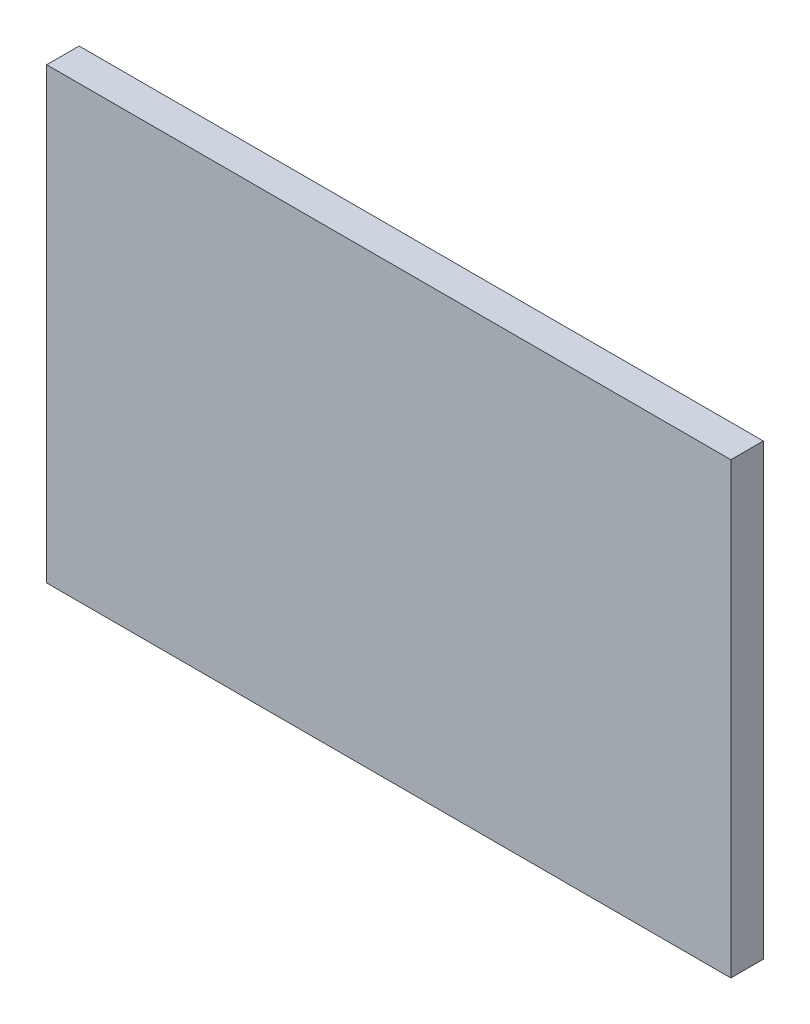
ISO-10303-21;
HEADER;
FILE_DESCRIPTION(('STEP AP214'),'2;1');
FILE_NAME('part.step','',(''),(''),'','','');
FILE_SCHEMA(('AUTOMOTIVE_DESIGN { 1 0 10303 214 1 1 1 1 }'));
ENDSEC;
DATA;
#1=APPLICATION_CONTEXT('core data for automotive mechanical design processes');
#2=APPLICATION_PROTOCOL_DEFINITION('international standard','automotive_design',2000,#1);
#3=PRODUCT_CONTEXT('',#1,'mechanical');
#4=PRODUCT('Part','Part','',(#3));
#5=PRODUCT_RELATED_PRODUCT_CATEGORY('part','',(#4));
#6=PRODUCT_DEFINITION_FORMATION('','',#4);
#7=PRODUCT_DEFINITION_CONTEXT('part definition',#1,'design');
#8=PRODUCT_DEFINITION('design','',#6,#7);
#9=PRODUCT_DEFINITION_SHAPE('','',#8);
#10=(LENGTH_UNIT() NAMED_UNIT(*) SI_UNIT(.MILLI.,.METRE.));
#11=(NAMED_UNIT(*) PLANE_ANGLE_UNIT() SI_UNIT($,.RADIAN.));
#12=(NAMED_UNIT(*) SI_UNIT($,.STERADIAN.) SOLID_ANGLE_UNIT());
#13=UNCERTAINTY_MEASURE_WITH_UNIT(LENGTH_MEASURE(1.E-05),#10,'distance_accuracy_value','');
#14=(GEOMETRIC_REPRESENTATION_CONTEXT(3) GLOBAL_UNCERTAINTY_ASSIGNED_CONTEXT((#13)) GLOBAL_UNIT_ASSIGNED_CONTEXT((#10,
#11,#12)) REPRESENTATION_CONTEXT('',''));
#15=CARTESIAN_POINT('',(0.,0.,0.));
#16=DIRECTION('',(0.,0.,1.));
#17=DIRECTION('',(1.,0.,0.));
#18=AXIS2_PLACEMENT_3D('',#15,#16,#17);
#19=CARTESIAN_POINT('',(-17.7,-16.75,3.24));
#20=DIRECTION('',(0.,0.,1.));
#21=DIRECTION('',(1.,0.,0.));
#22=AXIS2_PLACEMENT_3D('',#19,#20,#21);
#23=PLANE('',#22);
#24=DIRECTION('',(1.,0.,0.));
#25=VECTOR('',#24,1.);
#26=CARTESIAN_POINT('',(-26.35,-28.1,3.24));
#27=LINE('',#26,#25);
#28=CARTESIAN_POINT('',(-35.,-28.1,3.24));
#29=VERTEX_POINT('',#28);
#30=CARTESIAN_POINT('',(-0.399999999999994,-28.1,3.24));
#31=VERTEX_POINT('',#30);
#32=EDGE_CURVE('E20',#29,#31,#27,.T.);
#33=ORIENTED_EDGE('',*,*,#32,.T.);
#34=DIRECTION('',(0.,1.,0.));
#35=VECTOR('',#34,1.);
#36=CARTESIAN_POINT('',(-0.4,-16.75,3.24));
#37=LINE('',#36,#35);
#38=CARTESIAN_POINT('',(-0.4,-5.4,3.24));
#39=VERTEX_POINT('',#38);
#40=EDGE_CURVE('E106',#31,#39,#37,.T.);
#41=ORIENTED_EDGE('',*,*,#40,.T.);
#42=DIRECTION('',(-1.,0.,0.));
#43=VECTOR('',#42,1.);
#44=CARTESIAN_POINT('',(-17.7,-5.4,3.24));
#45=LINE('',#44,#43);
#46=CARTESIAN_POINT('',(-35.,-5.4,3.24));
#47=VERTEX_POINT('',#46);
#48=EDGE_CURVE('E75',#39,#47,#45,.T.);
#49=ORIENTED_EDGE('',*,*,#48,.T.);
#50=DIRECTION('',(0.,-1.,0.));
#51=VECTOR('',#50,1.);
#52=CARTESIAN_POINT('',(-35.,-16.75,3.24));
#53=LINE('',#52,#51);
#54=EDGE_CURVE('E11',#47,#29,#53,.T.);
#55=ORIENTED_EDGE('',*,*,#54,.T.);
#56=EDGE_LOOP('',(#33,#41,#49,#55));
#57=FACE_BOUND('',#56,.T.);
#58=ADVANCED_FACE('F16',(#57),#23,.T.);
#59=CARTESIAN_POINT('',(-17.7,-16.75,1.6));
#60=DIRECTION('',(0.,0.,1.));
#61=DIRECTION('',(1.,0.,0.));
#62=AXIS2_PLACEMENT_3D('',#59,#60,#61);
#63=PLANE('',#62);
#64=DIRECTION('',(1.,0.,0.));
#65=VECTOR('',#64,1.);
#66=CARTESIAN_POINT('',(-26.35,-28.1,1.6));
#67=LINE('',#66,#65);
#68=CARTESIAN_POINT('',(-35.,-28.1,1.6));
#69=VERTEX_POINT('',#68);
#70=CARTESIAN_POINT('',(-0.399999999999994,-28.1,1.6));
#71=VERTEX_POINT('',#70);
#72=EDGE_CURVE('E94',#69,#71,#67,.T.);
#73=ORIENTED_EDGE('',*,*,#72,.F.);
#74=DIRECTION('',(0.,-1.,0.));
#75=VECTOR('',#74,1.);
#76=CARTESIAN_POINT('',(-35.,-16.75,1.6));
#77=LINE('',#76,#75);
#78=CARTESIAN_POINT('',(-35.,-5.4,1.6));
#79=VERTEX_POINT('',#78);
#80=EDGE_CURVE('E27',#79,#69,#77,.T.);
#81=ORIENTED_EDGE('',*,*,#80,.F.);
#82=DIRECTION('',(-1.,0.,0.));
#83=VECTOR('',#82,1.);
#84=CARTESIAN_POINT('',(-17.7,-5.4,1.6));
#85=LINE('',#84,#83);
#86=CARTESIAN_POINT('',(-0.4,-5.4,1.6));
#87=VERTEX_POINT('',#86);
#88=EDGE_CURVE('E65',#87,#79,#85,.T.);
#89=ORIENTED_EDGE('',*,*,#88,.F.);
#90=DIRECTION('',(0.,1.,0.));
#91=VECTOR('',#90,1.);
#92=CARTESIAN_POINT('',(-0.4,-16.75,1.6));
#93=LINE('',#92,#91);
#94=EDGE_CURVE('E84',#71,#87,#93,.T.);
#95=ORIENTED_EDGE('',*,*,#94,.F.);
#96=EDGE_LOOP('',(#73,#81,#89,#95));
#97=FACE_BOUND('',#96,.T.);
#98=ADVANCED_FACE('F18',(#97),#63,.F.);
#99=CARTESIAN_POINT('',(-35.,-16.75,3.24));
#100=DIRECTION('',(1.,0.,0.));
#101=DIRECTION('',(0.,1.,0.));
#102=AXIS2_PLACEMENT_3D('',#99,#100,#101);
#103=PLANE('',#102);
#104=ORIENTED_EDGE('',*,*,#80,.T.);
#105=DIRECTION('',(0.,0.,-1.));
#106=VECTOR('',#105,1.);
#107=CARTESIAN_POINT('',(-35.,-28.1,3.24));
#108=LINE('',#107,#106);
#109=EDGE_CURVE('E78',#29,#69,#108,.T.);
#110=ORIENTED_EDGE('',*,*,#109,.F.);
#111=ORIENTED_EDGE('',*,*,#54,.F.);
#112=DIRECTION('',(0.,0.,-1.));
#113=VECTOR('',#112,1.);
#114=CARTESIAN_POINT('',(-35.,-5.4,3.24));
#115=LINE('',#114,#113);
#116=EDGE_CURVE('E108',#47,#79,#115,.T.);
#117=ORIENTED_EDGE('',*,*,#116,.T.);
#118=EDGE_LOOP('',(#104,#110,#111,#117));
#119=FACE_BOUND('',#118,.T.);
#120=ADVANCED_FACE('F79',(#119),#103,.F.);
#121=CARTESIAN_POINT('',(-17.7,-5.4,3.24));
#122=DIRECTION('',(0.,-1.,0.));
#123=DIRECTION('',(0.,0.,-1.));
#124=AXIS2_PLACEMENT_3D('',#121,#122,#123);
#125=PLANE('',#124);
#126=ORIENTED_EDGE('',*,*,#88,.T.);
#127=ORIENTED_EDGE('',*,*,#116,.F.);
#128=ORIENTED_EDGE('',*,*,#48,.F.);
#129=DIRECTION('',(0.,0.,-1.));
#130=VECTOR('',#129,1.);
#131=CARTESIAN_POINT('',(-0.4,-5.4,3.24));
#132=LINE('',#131,#130);
#133=EDGE_CURVE('E105',#39,#87,#132,.T.);
#134=ORIENTED_EDGE('',*,*,#133,.T.);
#135=EDGE_LOOP('',(#126,#127,#128,#134));
#136=FACE_BOUND('',#135,.T.);
#137=ADVANCED_FACE('F121',(#136),#125,.F.);
#138=CARTESIAN_POINT('',(-0.4,-16.75,3.24));
#139=DIRECTION('',(-1.,0.,0.));
#140=DIRECTION('',(0.,1.,0.));
#141=AXIS2_PLACEMENT_3D('',#138,#139,#140);
#142=PLANE('',#141);
#143=ORIENTED_EDGE('',*,*,#94,.T.);
#144=ORIENTED_EDGE('',*,*,#133,.F.);
#145=ORIENTED_EDGE('',*,*,#40,.F.);
#146=DIRECTION('',(0.,0.,-1.));
#147=VECTOR('',#146,1.);
#148=CARTESIAN_POINT('',(-0.399999999999994,-28.1,3.24));
#149=LINE('',#148,#147);
#150=EDGE_CURVE('E88',#31,#71,#149,.T.);
#151=ORIENTED_EDGE('',*,*,#150,.T.);
#152=EDGE_LOOP('',(#143,#144,#145,#151));
#153=FACE_BOUND('',#152,.T.);
#154=ADVANCED_FACE('F122',(#153),#142,.F.);
#155=CARTESIAN_POINT('',(-26.35,-28.1,3.24));
#156=DIRECTION('',(0.,1.,0.));
#157=DIRECTION('',(1.,0.,0.));
#158=AXIS2_PLACEMENT_3D('',#155,#156,#157);
#159=PLANE('',#158);
#160=ORIENTED_EDGE('',*,*,#72,.T.);
#161=ORIENTED_EDGE('',*,*,#150,.F.);
#162=ORIENTED_EDGE('',*,*,#32,.F.);
#163=ORIENTED_EDGE('',*,*,#109,.T.);
#164=EDGE_LOOP('',(#160,#161,#162,#163));
#165=FACE_BOUND('',#164,.T.);
#166=ADVANCED_FACE('F86',(#165),#159,.F.);
#167=CLOSED_SHELL('',(#58,#98,#120,#137,#154,#166));
#168=MANIFOLD_SOLID_BREP('B1',#167);
#169=ADVANCED_BREP_SHAPE_REPRESENTATION('',(#18,#168),#14);
#170=SHAPE_DEFINITION_REPRESENTATION(#9,#169);
ENDSEC;
END-ISO-10303-21;
